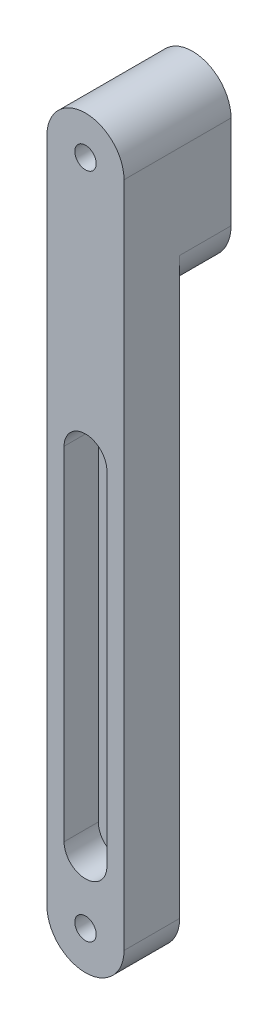
ISO-10303-21;
HEADER;
FILE_DESCRIPTION(('STEP AP214'),'2;1');
FILE_NAME('part.step','',(''),(''),'','','');
FILE_SCHEMA(('AUTOMOTIVE_DESIGN { 1 0 10303 214 1 1 1 1 }'));
ENDSEC;
DATA;
#1=APPLICATION_CONTEXT('core data for automotive mechanical design processes');
#2=APPLICATION_PROTOCOL_DEFINITION('international standard','automotive_design',2000,#1);
#3=PRODUCT_CONTEXT('',#1,'mechanical');
#4=PRODUCT('Part','Part','',(#3));
#5=PRODUCT_RELATED_PRODUCT_CATEGORY('part','',(#4));
#6=PRODUCT_DEFINITION_FORMATION('','',#4);
#7=PRODUCT_DEFINITION_CONTEXT('part definition',#1,'design');
#8=PRODUCT_DEFINITION('design','',#6,#7);
#9=PRODUCT_DEFINITION_SHAPE('','',#8);
#10=(LENGTH_UNIT() NAMED_UNIT(*) SI_UNIT(.MILLI.,.METRE.));
#11=(NAMED_UNIT(*) PLANE_ANGLE_UNIT() SI_UNIT($,.RADIAN.));
#12=(NAMED_UNIT(*) SI_UNIT($,.STERADIAN.) SOLID_ANGLE_UNIT());
#13=UNCERTAINTY_MEASURE_WITH_UNIT(LENGTH_MEASURE(1.E-05),#10,'distance_accuracy_value','');
#14=(GEOMETRIC_REPRESENTATION_CONTEXT(3) GLOBAL_UNCERTAINTY_ASSIGNED_CONTEXT((#13)) GLOBAL_UNIT_ASSIGNED_CONTEXT((#10,
#11,#12)) REPRESENTATION_CONTEXT('',''));
#15=CARTESIAN_POINT('',(0.,0.,0.));
#16=DIRECTION('',(0.,0.,1.));
#17=DIRECTION('',(1.,0.,0.));
#18=AXIS2_PLACEMENT_3D('',#15,#16,#17);
#19=CARTESIAN_POINT('',(0.,56.3943241889826,0.));
#20=DIRECTION('',(0.,0.,1.));
#21=DIRECTION('',(1.,0.,0.));
#22=AXIS2_PLACEMENT_3D('',#19,#20,#21);
#23=PLANE('',#22);
#24=CARTESIAN_POINT('',(0.,-99.5196758110174,0.));
#25=DIRECTION('',(0.,0.,1.));
#26=DIRECTION('',(1.,0.,0.));
#27=AXIS2_PLACEMENT_3D('',#24,#25,#26);
#28=CIRCLE('',#27,2.5);
#29=CARTESIAN_POINT('',(-2.49999999999998,-99.5196758110174,0.));
#30=VERTEX_POINT('',#29);
#31=EDGE_CURVE('E168',#30,#30,#28,.T.);
#32=ORIENTED_EDGE('',*,*,#31,.T.);
#33=EDGE_LOOP('',(#32));
#34=FACE_BOUND('',#33,.T.);
#35=DIRECTION('',(0.,-1.,0.));
#36=VECTOR('',#35,1.);
#37=CARTESIAN_POINT('',(-9.,56.3943241889826,0.));
#38=LINE('',#37,#36);
#39=CARTESIAN_POINT('',(-9.,34.3835962839502,0.));
#40=VERTEX_POINT('',#39);
#41=CARTESIAN_POINT('',(-8.99999999999998,-99.5196758110174,0.));
#42=VERTEX_POINT('',#41);
#43=EDGE_CURVE('E45',#40,#42,#38,.T.);
#44=ORIENTED_EDGE('',*,*,#43,.F.);
#45=CARTESIAN_POINT('',(1.,34.3835962839502,0.));
#46=DIRECTION('',(0.,0.,1.));
#47=DIRECTION('',(1.,0.,0.));
#48=AXIS2_PLACEMENT_3D('',#45,#46,#47);
#49=CIRCLE('',#48,10.);
#50=CARTESIAN_POINT('',(-0.999999999999996,24.5856373128174,0.));
#51=VERTEX_POINT('',#50);
#52=EDGE_CURVE('E11',#40,#51,#49,.T.);
#53=ORIENTED_EDGE('',*,*,#52,.T.);
#54=CARTESIAN_POINT('',(-0.999999999999996,34.5856373128174,0.));
#55=DIRECTION('',(0.,0.,1.));
#56=DIRECTION('',(1.,0.,0.));
#57=AXIS2_PLACEMENT_3D('',#54,#55,#56);
#58=CIRCLE('',#57,10.);
#59=CARTESIAN_POINT('',(9.,34.5856373128174,0.));
#60=VERTEX_POINT('',#59);
#61=EDGE_CURVE('E205',#51,#60,#58,.T.);
#62=ORIENTED_EDGE('',*,*,#61,.T.);
#63=DIRECTION('',(0.,1.,0.));
#64=VECTOR('',#63,1.);
#65=CARTESIAN_POINT('',(9.00000000000002,-99.5196758110174,0.));
#66=LINE('',#65,#64);
#67=CARTESIAN_POINT('',(9.00000000000002,-99.5196758110174,0.));
#68=VERTEX_POINT('',#67);
#69=EDGE_CURVE('E185',#68,#60,#66,.T.);
#70=ORIENTED_EDGE('',*,*,#69,.F.);
#71=CARTESIAN_POINT('',(0.,-99.5196758110174,0.));
#72=DIRECTION('',(0.,0.,1.));
#73=DIRECTION('',(1.,0.,0.));
#74=AXIS2_PLACEMENT_3D('',#71,#72,#73);
#75=CIRCLE('',#74,9.);
#76=EDGE_CURVE('E192',#42,#68,#75,.T.);
#77=ORIENTED_EDGE('',*,*,#76,.F.);
#78=EDGE_LOOP('',(#44,#53,#62,#70,#77));
#79=FACE_BOUND('',#78,.T.);
#80=ADVANCED_FACE('F31',(#34,#79),#23,.F.);
#81=CARTESIAN_POINT('',(0.,56.3943241889826,13.));
#82=DIRECTION('',(0.,0.,1.));
#83=DIRECTION('',(1.,0.,0.));
#84=AXIS2_PLACEMENT_3D('',#81,#82,#83);
#85=PLANE('',#84);
#86=CARTESIAN_POINT('',(0.,-84.5196758110174,13.));
#87=DIRECTION('',(0.,0.,1.));
#88=DIRECTION('',(1.,0.,0.));
#89=AXIS2_PLACEMENT_3D('',#86,#87,#88);
#90=CIRCLE('',#89,5.);
#91=CARTESIAN_POINT('',(-4.99999999999998,-84.5196758110174,13.));
#92=VERTEX_POINT('',#91);
#93=CARTESIAN_POINT('',(5.00000000000002,-84.5196758110174,13.));
#94=VERTEX_POINT('',#93);
#95=EDGE_CURVE('E142',#92,#94,#90,.T.);
#96=ORIENTED_EDGE('',*,*,#95,.F.);
#97=DIRECTION('',(0.,-1.,0.));
#98=VECTOR('',#97,1.);
#99=CARTESIAN_POINT('',(-4.99999999999999,-4.51967581101744,13.));
#100=LINE('',#99,#98);
#101=CARTESIAN_POINT('',(-4.99999999999999,-4.51967581101744,13.));
#102=VERTEX_POINT('',#101);
#103=EDGE_CURVE('E147',#102,#92,#100,.T.);
#104=ORIENTED_EDGE('',*,*,#103,.F.);
#105=CARTESIAN_POINT('',(0.,-4.51967581101743,13.));
#106=DIRECTION('',(0.,0.,1.));
#107=DIRECTION('',(1.,0.,0.));
#108=AXIS2_PLACEMENT_3D('',#105,#106,#107);
#109=CIRCLE('',#108,5.);
#110=CARTESIAN_POINT('',(5.00000000000001,-4.51967581101743,13.));
#111=VERTEX_POINT('',#110);
#112=EDGE_CURVE('E161',#111,#102,#109,.T.);
#113=ORIENTED_EDGE('',*,*,#112,.F.);
#114=DIRECTION('',(0.,1.,0.));
#115=VECTOR('',#114,1.);
#116=CARTESIAN_POINT('',(5.00000000000002,-84.5196758110174,13.));
#117=LINE('',#116,#115);
#118=EDGE_CURVE('E158',#94,#111,#117,.T.);
#119=ORIENTED_EDGE('',*,*,#118,.F.);
#120=EDGE_LOOP('',(#96,#104,#113,#119));
#121=FACE_BOUND('',#120,.T.);
#122=CARTESIAN_POINT('',(0.,56.3943241889826,13.));
#123=DIRECTION('',(0.,0.,1.));
#124=DIRECTION('',(1.,0.,0.));
#125=AXIS2_PLACEMENT_3D('',#122,#123,#124);
#126=CIRCLE('',#125,2.5);
#127=CARTESIAN_POINT('',(-2.5,56.3943241889826,13.));
#128=VERTEX_POINT('',#127);
#129=EDGE_CURVE('E178',#128,#128,#126,.T.);
#130=ORIENTED_EDGE('',*,*,#129,.F.);
#131=EDGE_LOOP('',(#130));
#132=FACE_BOUND('',#131,.T.);
#133=CARTESIAN_POINT('',(0.,56.3943241889826,13.));
#134=DIRECTION('',(0.,0.,1.));
#135=DIRECTION('',(1.,0.,0.));
#136=AXIS2_PLACEMENT_3D('',#133,#134,#135);
#137=CIRCLE('',#136,9.);
#138=CARTESIAN_POINT('',(9.,56.3943241889826,13.));
#139=VERTEX_POINT('',#138);
#140=CARTESIAN_POINT('',(-9.,56.3943241889826,13.));
#141=VERTEX_POINT('',#140);
#142=EDGE_CURVE('E120',#139,#141,#137,.T.);
#143=ORIENTED_EDGE('',*,*,#142,.T.);
#144=DIRECTION('',(0.,-1.,0.));
#145=VECTOR('',#144,1.);
#146=CARTESIAN_POINT('',(-9.,56.3943241889826,13.));
#147=LINE('',#146,#145);
#148=CARTESIAN_POINT('',(-8.99999999999998,-99.5196758110174,13.));
#149=VERTEX_POINT('',#148);
#150=EDGE_CURVE('E184',#141,#149,#147,.T.);
#151=ORIENTED_EDGE('',*,*,#150,.T.);
#152=CARTESIAN_POINT('',(0.,-99.5196758110174,13.));
#153=DIRECTION('',(0.,0.,1.));
#154=DIRECTION('',(1.,0.,0.));
#155=AXIS2_PLACEMENT_3D('',#152,#153,#154);
#156=CIRCLE('',#155,9.);
#157=CARTESIAN_POINT('',(9.00000000000002,-99.5196758110174,13.));
#158=VERTEX_POINT('',#157);
#159=EDGE_CURVE('E187',#149,#158,#156,.T.);
#160=ORIENTED_EDGE('',*,*,#159,.T.);
#161=DIRECTION('',(0.,1.,0.));
#162=VECTOR('',#161,1.);
#163=CARTESIAN_POINT('',(9.00000000000002,-99.5196758110174,13.));
#164=LINE('',#163,#162);
#165=EDGE_CURVE('E124',#158,#139,#164,.T.);
#166=ORIENTED_EDGE('',*,*,#165,.T.);
#167=EDGE_LOOP('',(#143,#151,#160,#166));
#168=FACE_BOUND('',#167,.T.);
#169=CARTESIAN_POINT('',(0.,-99.5196758110174,13.));
#170=DIRECTION('',(0.,0.,1.));
#171=DIRECTION('',(1.,0.,0.));
#172=AXIS2_PLACEMENT_3D('',#169,#170,#171);
#173=CIRCLE('',#172,2.5);
#174=CARTESIAN_POINT('',(-2.49999999999998,-99.5196758110174,13.));
#175=VERTEX_POINT('',#174);
#176=EDGE_CURVE('E175',#175,#175,#173,.T.);
#177=ORIENTED_EDGE('',*,*,#176,.F.);
#178=EDGE_LOOP('',(#177));
#179=FACE_BOUND('',#178,.T.);
#180=ADVANCED_FACE('F231',(#121,#132,#168,#179),#85,.T.);
#181=CARTESIAN_POINT('',(0.,56.3943241889826,13.));
#182=DIRECTION('',(0.,0.,-1.));
#183=DIRECTION('',(-1.,0.,0.));
#184=AXIS2_PLACEMENT_3D('',#181,#182,#183);
#185=CYLINDRICAL_SURFACE('',#184,9.);
#186=DIRECTION('',(0.,0.,-1.));
#187=VECTOR('',#186,1.);
#188=CARTESIAN_POINT('',(9.,56.3943241889826,13.));
#189=LINE('',#188,#187);
#190=CARTESIAN_POINT('',(9.,56.3943241889826,-12.));
#191=VERTEX_POINT('',#190);
#192=EDGE_CURVE('E113',#139,#191,#189,.T.);
#193=ORIENTED_EDGE('',*,*,#192,.T.);
#194=CARTESIAN_POINT('',(0.,56.3943241889826,-12.));
#195=DIRECTION('',(0.,0.,-1.));
#196=DIRECTION('',(-1.,0.,0.));
#197=AXIS2_PLACEMENT_3D('',#194,#195,#196);
#198=CIRCLE('',#197,9.);
#199=CARTESIAN_POINT('',(-9.,56.3943241889826,-12.));
#200=VERTEX_POINT('',#199);
#201=EDGE_CURVE('E118',#200,#191,#198,.T.);
#202=ORIENTED_EDGE('',*,*,#201,.F.);
#203=DIRECTION('',(0.,0.,-1.));
#204=VECTOR('',#203,1.);
#205=CARTESIAN_POINT('',(-9.,56.3943241889826,13.));
#206=LINE('',#205,#204);
#207=EDGE_CURVE('E201',#141,#200,#206,.T.);
#208=ORIENTED_EDGE('',*,*,#207,.F.);
#209=ORIENTED_EDGE('',*,*,#142,.F.);
#210=EDGE_LOOP('',(#193,#202,#208,#209));
#211=FACE_BOUND('',#210,.T.);
#212=ADVANCED_FACE('F115',(#211),#185,.T.);
#213=CARTESIAN_POINT('',(-9.,56.3943241889826,13.));
#214=DIRECTION('',(1.,0.,0.));
#215=DIRECTION('',(0.,1.,0.));
#216=AXIS2_PLACEMENT_3D('',#213,#214,#215);
#217=PLANE('',#216);
#218=DIRECTION('',(0.,1.,0.));
#219=VECTOR('',#218,1.);
#220=CARTESIAN_POINT('',(-9.,24.5856373128174,-12.));
#221=LINE('',#220,#219);
#222=CARTESIAN_POINT('',(-9.,34.3835962839502,-12.));
#223=VERTEX_POINT('',#222);
#224=EDGE_CURVE('E132',#223,#200,#221,.T.);
#225=ORIENTED_EDGE('',*,*,#224,.F.);
#226=DIRECTION('',(0.,0.,1.));
#227=VECTOR('',#226,1.);
#228=CARTESIAN_POINT('',(-9.,34.3835962839502,13.));
#229=LINE('',#228,#227);
#230=EDGE_CURVE('E208',#223,#40,#229,.T.);
#231=ORIENTED_EDGE('',*,*,#230,.T.);
#232=ORIENTED_EDGE('',*,*,#43,.T.);
#233=DIRECTION('',(0.,0.,-1.));
#234=VECTOR('',#233,1.);
#235=CARTESIAN_POINT('',(-8.99999999999998,-99.5196758110174,13.));
#236=LINE('',#235,#234);
#237=EDGE_CURVE('E394',#149,#42,#236,.T.);
#238=ORIENTED_EDGE('',*,*,#237,.F.);
#239=ORIENTED_EDGE('',*,*,#150,.F.);
#240=ORIENTED_EDGE('',*,*,#207,.T.);
#241=EDGE_LOOP('',(#225,#231,#232,#238,#239,#240));
#242=FACE_BOUND('',#241,.T.);
#243=ADVANCED_FACE('F212',(#242),#217,.F.);
#244=CARTESIAN_POINT('',(0.,-99.5196758110174,13.));
#245=DIRECTION('',(0.,0.,-1.));
#246=DIRECTION('',(-1.,0.,0.));
#247=AXIS2_PLACEMENT_3D('',#244,#245,#246);
#248=CYLINDRICAL_SURFACE('',#247,9.);
#249=ORIENTED_EDGE('',*,*,#76,.T.);
#250=DIRECTION('',(0.,0.,-1.));
#251=VECTOR('',#250,1.);
#252=CARTESIAN_POINT('',(9.00000000000002,-99.5196758110174,13.));
#253=LINE('',#252,#251);
#254=EDGE_CURVE('E123',#158,#68,#253,.T.);
#255=ORIENTED_EDGE('',*,*,#254,.F.);
#256=ORIENTED_EDGE('',*,*,#159,.F.);
#257=ORIENTED_EDGE('',*,*,#237,.T.);
#258=EDGE_LOOP('',(#249,#255,#256,#257));
#259=FACE_BOUND('',#258,.T.);
#260=ADVANCED_FACE('F244',(#259),#248,.T.);
#261=CARTESIAN_POINT('',(9.00000000000002,-99.5196758110174,13.));
#262=DIRECTION('',(-1.,0.,0.));
#263=DIRECTION('',(0.,-1.,0.));
#264=AXIS2_PLACEMENT_3D('',#261,#262,#263);
#265=PLANE('',#264);
#266=ORIENTED_EDGE('',*,*,#69,.T.);
#267=DIRECTION('',(0.,0.,1.));
#268=VECTOR('',#267,1.);
#269=CARTESIAN_POINT('',(9.,34.5856373128175,13.));
#270=LINE('',#269,#268);
#271=CARTESIAN_POINT('',(9.,34.5856373128174,-12.));
#272=VERTEX_POINT('',#271);
#273=EDGE_CURVE('E130',#60,#272,#270,.F.);
#274=ORIENTED_EDGE('',*,*,#273,.T.);
#275=DIRECTION('',(0.,-1.,0.));
#276=VECTOR('',#275,1.);
#277=CARTESIAN_POINT('',(9.,56.3943241889826,-12.));
#278=LINE('',#277,#276);
#279=EDGE_CURVE('E127',#191,#272,#278,.T.);
#280=ORIENTED_EDGE('',*,*,#279,.F.);
#281=ORIENTED_EDGE('',*,*,#192,.F.);
#282=ORIENTED_EDGE('',*,*,#165,.F.);
#283=ORIENTED_EDGE('',*,*,#254,.T.);
#284=EDGE_LOOP('',(#266,#274,#280,#281,#282,#283));
#285=FACE_BOUND('',#284,.T.);
#286=ADVANCED_FACE('F128',(#285),#265,.F.);
#287=CARTESIAN_POINT('',(0.,56.3943241889826,13.));
#288=DIRECTION('',(0.,0.,-1.));
#289=DIRECTION('',(-1.,0.,0.));
#290=AXIS2_PLACEMENT_3D('',#287,#288,#289);
#291=CYLINDRICAL_SURFACE('',#290,2.5);
#292=CARTESIAN_POINT('',(0.,56.3943241889826,-12.));
#293=DIRECTION('',(0.,0.,1.));
#294=DIRECTION('',(1.,0.,0.));
#295=AXIS2_PLACEMENT_3D('',#292,#293,#294);
#296=CIRCLE('',#295,2.5);
#297=CARTESIAN_POINT('',(-2.5,56.3943241889826,-12.));
#298=VERTEX_POINT('',#297);
#299=EDGE_CURVE('E136',#298,#298,#296,.T.);
#300=CARTESIAN_POINT('',(-2.5,56.3943241889826,13.));
#301=CARTESIAN_POINT('',(-2.5,56.3943241889826,12.7395833333333));
#302=CARTESIAN_POINT('',(-2.5,56.3943241889826,12.4791666666667));
#303=CARTESIAN_POINT('',(-2.5,56.3943241889826,11.9583333333333));
#304=CARTESIAN_POINT('',(-2.5,56.3943241889826,11.6979166666667));
#305=CARTESIAN_POINT('',(-2.5,56.3943241889826,11.1770833333333));
#306=CARTESIAN_POINT('',(-2.5,56.3943241889826,10.9166666666667));
#307=CARTESIAN_POINT('',(-2.5,56.3943241889826,10.3958333333333));
#308=CARTESIAN_POINT('',(-2.5,56.3943241889826,10.1354166666667));
#309=CARTESIAN_POINT('',(-2.5,56.3943241889826,9.61458333333333));
#310=CARTESIAN_POINT('',(-2.5,56.3943241889826,9.35416666666666));
#311=CARTESIAN_POINT('',(-2.5,56.3943241889826,8.83333333333333));
#312=CARTESIAN_POINT('',(-2.5,56.3943241889826,8.57291666666666));
#313=CARTESIAN_POINT('',(-2.5,56.3943241889826,8.05208333333333));
#314=CARTESIAN_POINT('',(-2.5,56.3943241889826,7.79166666666666));
#315=CARTESIAN_POINT('',(-2.5,56.3943241889826,7.27083333333333));
#316=CARTESIAN_POINT('',(-2.5,56.3943241889826,7.01041666666666));
#317=CARTESIAN_POINT('',(-2.5,56.3943241889826,6.48958333333333));
#318=CARTESIAN_POINT('',(-2.5,56.3943241889826,6.22916666666666));
#319=CARTESIAN_POINT('',(-2.5,56.3943241889826,5.70833333333333));
#320=CARTESIAN_POINT('',(-2.5,56.3943241889826,5.44791666666666));
#321=CARTESIAN_POINT('',(-2.5,56.3943241889826,4.92708333333333));
#322=CARTESIAN_POINT('',(-2.5,56.3943241889826,4.66666666666667));
#323=CARTESIAN_POINT('',(-2.5,56.3943241889826,4.14583333333333));
#324=CARTESIAN_POINT('',(-2.5,56.3943241889826,3.88541666666667));
#325=CARTESIAN_POINT('',(-2.5,56.3943241889826,3.36458333333333));
#326=CARTESIAN_POINT('',(-2.5,56.3943241889826,3.10416666666666));
#327=CARTESIAN_POINT('',(-2.5,56.3943241889826,2.58333333333333));
#328=CARTESIAN_POINT('',(-2.5,56.3943241889826,2.32291666666666));
#329=CARTESIAN_POINT('',(-2.5,56.3943241889826,1.80208333333333));
#330=CARTESIAN_POINT('',(-2.5,56.3943241889826,1.54166666666666));
#331=CARTESIAN_POINT('',(-2.5,56.3943241889826,1.02083333333333));
#332=CARTESIAN_POINT('',(-2.5,56.3943241889826,0.760416666666664));
#333=CARTESIAN_POINT('',(-2.5,56.3943241889826,0.23958333333333));
#334=CARTESIAN_POINT('',(-2.5,56.3943241889826,-0.0208333333333368));
#335=CARTESIAN_POINT('',(-2.5,56.3943241889826,-0.541666666666671));
#336=CARTESIAN_POINT('',(-2.5,56.3943241889826,-0.802083333333338));
#337=CARTESIAN_POINT('',(-2.5,56.3943241889826,-1.32291666666667));
#338=CARTESIAN_POINT('',(-2.5,56.3943241889826,-1.58333333333334));
#339=CARTESIAN_POINT('',(-2.5,56.3943241889826,-2.10416666666667));
#340=CARTESIAN_POINT('',(-2.5,56.3943241889826,-2.36458333333334));
#341=CARTESIAN_POINT('',(-2.5,56.3943241889826,-2.88541666666667));
#342=CARTESIAN_POINT('',(-2.5,56.3943241889826,-3.14583333333334));
#343=CARTESIAN_POINT('',(-2.5,56.3943241889826,-3.66666666666667));
#344=CARTESIAN_POINT('',(-2.5,56.3943241889826,-3.92708333333334));
#345=CARTESIAN_POINT('',(-2.5,56.3943241889826,-4.44791666666667));
#346=CARTESIAN_POINT('',(-2.5,56.3943241889826,-4.70833333333334));
#347=CARTESIAN_POINT('',(-2.5,56.3943241889826,-5.22916666666667));
#348=CARTESIAN_POINT('',(-2.5,56.3943241889826,-5.48958333333334));
#349=CARTESIAN_POINT('',(-2.5,56.3943241889826,-6.01041666666667));
#350=CARTESIAN_POINT('',(-2.5,56.3943241889826,-6.27083333333334));
#351=CARTESIAN_POINT('',(-2.5,56.3943241889826,-6.79166666666667));
#352=CARTESIAN_POINT('',(-2.5,56.3943241889826,-7.05208333333334));
#353=CARTESIAN_POINT('',(-2.5,56.3943241889826,-7.57291666666667));
#354=CARTESIAN_POINT('',(-2.5,56.3943241889826,-7.83333333333334));
#355=CARTESIAN_POINT('',(-2.5,56.3943241889826,-8.35416666666667));
#356=CARTESIAN_POINT('',(-2.5,56.3943241889826,-8.61458333333334));
#357=CARTESIAN_POINT('',(-2.5,56.3943241889826,-9.13541666666667));
#358=CARTESIAN_POINT('',(-2.5,56.3943241889826,-9.39583333333334));
#359=CARTESIAN_POINT('',(-2.5,56.3943241889826,-9.91666666666667));
#360=CARTESIAN_POINT('',(-2.5,56.3943241889826,-10.1770833333333));
#361=CARTESIAN_POINT('',(-2.5,56.3943241889826,-10.6979166666667));
#362=CARTESIAN_POINT('',(-2.5,56.3943241889826,-10.9583333333333));
#363=CARTESIAN_POINT('',(-2.5,56.3943241889826,-11.4791666666667));
#364=CARTESIAN_POINT('',(-2.5,56.3943241889826,-11.7395833333333));
#365=CARTESIAN_POINT('',(-2.5,56.3943241889826,-12.));
#366=B_SPLINE_CURVE_WITH_KNOTS('',3,(#300,#301,#302,#303,#304,#305,#306,#307,#308,#309,#310,
#311,#312,#313,#314,#315,#316,#317,#318,#319,#320,#321,#322,#323,#324,#325,#326,#327,#328,#329,
#330,#331,#332,#333,#334,#335,#336,#337,#338,#339,#340,#341,#342,#343,#344,#345,#346,#347,#348,
#349,#350,#351,#352,#353,#354,#355,#356,#357,#358,#359,#360,#361,#362,#363,#364,#365),
.UNSPECIFIED.,.F.,.F.,(4,2,2,2,2,2,2,2,2,2,2,2,2,2,2,2,2,2,2,2,2,2,2,2,2,2,2,2,2,2,2,2,4),(0.,
0.781250000000001,1.5625,2.34375,3.125,3.90625,4.6875,5.46875,6.25,7.03125,7.8125,8.59375,9.375,
10.15625,10.9375,11.71875,12.5,13.28125,14.0625,14.84375,15.625,16.40625,17.1875,17.96875,18.75,
19.53125,20.3125,21.09375,21.875,22.65625,23.4375,24.21875,25.),.UNSPECIFIED.);
#367=EDGE_CURVE('BSEAM243',#128,#298,#366,.T.);
#368=ORIENTED_EDGE('',*,*,#129,.T.);
#369=ORIENTED_EDGE('',*,*,#299,.F.);
#370=ORIENTED_EDGE('',*,*,#367,.T.);
#371=ORIENTED_EDGE('',*,*,#367,.F.);
#372=EDGE_LOOP('',(#368,#370,#369,#371));
#373=FACE_BOUND('',#372,.T.);
#374=ADVANCED_FACE('F243',(#373),#291,.F.);
#375=CARTESIAN_POINT('',(0.,-99.5196758110174,13.));
#376=DIRECTION('',(0.,0.,-1.));
#377=DIRECTION('',(-1.,0.,0.));
#378=AXIS2_PLACEMENT_3D('',#375,#376,#377);
#379=CYLINDRICAL_SURFACE('',#378,2.5);
#380=CARTESIAN_POINT('',(-2.49999999999998,-99.5196758110174,13.));
#381=CARTESIAN_POINT('',(-2.49999999999998,-99.5196758110174,12.8645833333333));
#382=CARTESIAN_POINT('',(-2.49999999999998,-99.5196758110174,12.7291666666667));
#383=CARTESIAN_POINT('',(-2.49999999999998,-99.5196758110174,12.4583333333333));
#384=CARTESIAN_POINT('',(-2.49999999999998,-99.5196758110174,12.3229166666667));
#385=CARTESIAN_POINT('',(-2.49999999999998,-99.5196758110174,12.0520833333333));
#386=CARTESIAN_POINT('',(-2.49999999999998,-99.5196758110174,11.9166666666667));
#387=CARTESIAN_POINT('',(-2.49999999999998,-99.5196758110174,11.6458333333333));
#388=CARTESIAN_POINT('',(-2.49999999999998,-99.5196758110174,11.5104166666667));
#389=CARTESIAN_POINT('',(-2.49999999999998,-99.5196758110174,11.2395833333333));
#390=CARTESIAN_POINT('',(-2.49999999999998,-99.5196758110174,11.1041666666667));
#391=CARTESIAN_POINT('',(-2.49999999999998,-99.5196758110174,10.8333333333333));
#392=CARTESIAN_POINT('',(-2.49999999999998,-99.5196758110174,10.6979166666667));
#393=CARTESIAN_POINT('',(-2.49999999999998,-99.5196758110174,10.4270833333333));
#394=CARTESIAN_POINT('',(-2.49999999999998,-99.5196758110174,10.2916666666667));
#395=CARTESIAN_POINT('',(-2.49999999999998,-99.5196758110174,10.0208333333333));
#396=CARTESIAN_POINT('',(-2.49999999999998,-99.5196758110174,9.88541666666667));
#397=CARTESIAN_POINT('',(-2.49999999999998,-99.5196758110174,9.61458333333333));
#398=CARTESIAN_POINT('',(-2.49999999999998,-99.5196758110174,9.47916666666667));
#399=CARTESIAN_POINT('',(-2.49999999999998,-99.5196758110174,9.20833333333333));
#400=CARTESIAN_POINT('',(-2.49999999999998,-99.5196758110174,9.07291666666667));
#401=CARTESIAN_POINT('',(-2.49999999999998,-99.5196758110174,8.80208333333333));
#402=CARTESIAN_POINT('',(-2.49999999999998,-99.5196758110174,8.66666666666667));
#403=CARTESIAN_POINT('',(-2.49999999999998,-99.5196758110174,8.39583333333333));
#404=CARTESIAN_POINT('',(-2.49999999999998,-99.5196758110174,8.26041666666667));
#405=CARTESIAN_POINT('',(-2.49999999999998,-99.5196758110174,7.98958333333333));
#406=CARTESIAN_POINT('',(-2.49999999999998,-99.5196758110174,7.85416666666667));
#407=CARTESIAN_POINT('',(-2.49999999999998,-99.5196758110174,7.58333333333333));
#408=CARTESIAN_POINT('',(-2.49999999999998,-99.5196758110174,7.44791666666667));
#409=CARTESIAN_POINT('',(-2.49999999999998,-99.5196758110174,7.17708333333333));
#410=CARTESIAN_POINT('',(-2.49999999999998,-99.5196758110174,7.04166666666667));
#411=CARTESIAN_POINT('',(-2.49999999999998,-99.5196758110174,6.77083333333333));
#412=CARTESIAN_POINT('',(-2.49999999999998,-99.5196758110174,6.63541666666667));
#413=CARTESIAN_POINT('',(-2.49999999999998,-99.5196758110174,6.36458333333333));
#414=CARTESIAN_POINT('',(-2.49999999999998,-99.5196758110174,6.22916666666667));
#415=CARTESIAN_POINT('',(-2.49999999999998,-99.5196758110174,5.95833333333333));
#416=CARTESIAN_POINT('',(-2.49999999999998,-99.5196758110174,5.82291666666667));
#417=CARTESIAN_POINT('',(-2.49999999999998,-99.5196758110174,5.55208333333333));
#418=CARTESIAN_POINT('',(-2.49999999999998,-99.5196758110174,5.41666666666667));
#419=CARTESIAN_POINT('',(-2.49999999999998,-99.5196758110174,5.14583333333333));
#420=CARTESIAN_POINT('',(-2.49999999999998,-99.5196758110174,5.01041666666667));
#421=CARTESIAN_POINT('',(-2.49999999999998,-99.5196758110174,4.73958333333333));
#422=CARTESIAN_POINT('',(-2.49999999999998,-99.5196758110174,4.60416666666667));
#423=CARTESIAN_POINT('',(-2.49999999999998,-99.5196758110174,4.33333333333333));
#424=CARTESIAN_POINT('',(-2.49999999999998,-99.5196758110174,4.19791666666667));
#425=CARTESIAN_POINT('',(-2.49999999999998,-99.5196758110174,3.92708333333333));
#426=CARTESIAN_POINT('',(-2.49999999999998,-99.5196758110174,3.79166666666667));
#427=CARTESIAN_POINT('',(-2.49999999999998,-99.5196758110174,3.52083333333333));
#428=CARTESIAN_POINT('',(-2.49999999999998,-99.5196758110174,3.38541666666667));
#429=CARTESIAN_POINT('',(-2.49999999999998,-99.5196758110174,3.11458333333333));
#430=CARTESIAN_POINT('',(-2.49999999999998,-99.5196758110174,2.97916666666667));
#431=CARTESIAN_POINT('',(-2.49999999999998,-99.5196758110174,2.70833333333333));
#432=CARTESIAN_POINT('',(-2.49999999999998,-99.5196758110174,2.57291666666667));
#433=CARTESIAN_POINT('',(-2.49999999999998,-99.5196758110174,2.30208333333333));
#434=CARTESIAN_POINT('',(-2.49999999999998,-99.5196758110174,2.16666666666667));
#435=CARTESIAN_POINT('',(-2.49999999999998,-99.5196758110174,1.89583333333333));
#436=CARTESIAN_POINT('',(-2.49999999999998,-99.5196758110174,1.76041666666667));
#437=CARTESIAN_POINT('',(-2.49999999999998,-99.5196758110174,1.48958333333333));
#438=CARTESIAN_POINT('',(-2.49999999999998,-99.5196758110174,1.35416666666667));
#439=CARTESIAN_POINT('',(-2.49999999999998,-99.5196758110174,1.08333333333333));
#440=CARTESIAN_POINT('',(-2.49999999999998,-99.5196758110174,0.947916666666667));
#441=CARTESIAN_POINT('',(-2.49999999999998,-99.5196758110174,0.677083333333334));
#442=CARTESIAN_POINT('',(-2.49999999999998,-99.5196758110174,0.541666666666667));
#443=CARTESIAN_POINT('',(-2.49999999999998,-99.5196758110174,0.270833333333334));
#444=CARTESIAN_POINT('',(-2.49999999999998,-99.5196758110174,0.135416666666667));
#445=CARTESIAN_POINT('',(-2.49999999999998,-99.5196758110174,0.));
#446=B_SPLINE_CURVE_WITH_KNOTS('',3,(#380,#381,#382,#383,#384,#385,#386,#387,#388,#389,#390,
#391,#392,#393,#394,#395,#396,#397,#398,#399,#400,#401,#402,#403,#404,#405,#406,#407,#408,#409,
#410,#411,#412,#413,#414,#415,#416,#417,#418,#419,#420,#421,#422,#423,#424,#425,#426,#427,#428,
#429,#430,#431,#432,#433,#434,#435,#436,#437,#438,#439,#440,#441,#442,#443,#444,#445),
.UNSPECIFIED.,.F.,.F.,(4,2,2,2,2,2,2,2,2,2,2,2,2,2,2,2,2,2,2,2,2,2,2,2,2,2,2,2,2,2,2,2,4),(0.,
0.406249999999999,0.812499999999999,1.21875,1.625,2.03125,2.4375,2.84375,3.25,3.65625,4.0625,
4.46875,4.875,5.28125,5.6875,6.09375,6.5,6.90625,7.3125,7.71875,8.125,8.53125,8.9375,9.34375,
9.75,10.15625,10.5625,10.96875,11.375,11.78125,12.1875,12.59375,13.),.UNSPECIFIED.);
#447=EDGE_CURVE('BSEAM274',#175,#30,#446,.T.);
#448=ORIENTED_EDGE('',*,*,#176,.T.);
#449=ORIENTED_EDGE('',*,*,#31,.F.);
#450=ORIENTED_EDGE('',*,*,#447,.T.);
#451=ORIENTED_EDGE('',*,*,#447,.F.);
#452=EDGE_LOOP('',(#448,#450,#449,#451));
#453=FACE_BOUND('',#452,.T.);
#454=ADVANCED_FACE('F274',(#453),#379,.F.);
#455=CARTESIAN_POINT('',(0.,-84.5196758110174,5.));
#456=DIRECTION('',(0.,0.,1.));
#457=DIRECTION('',(1.,0.,0.));
#458=AXIS2_PLACEMENT_3D('',#455,#456,#457);
#459=CYLINDRICAL_SURFACE('',#458,5.);
#460=ORIENTED_EDGE('',*,*,#95,.T.);
#461=DIRECTION('',(0.,0.,1.));
#462=VECTOR('',#461,1.);
#463=CARTESIAN_POINT('',(5.00000000000002,-84.5196758110174,5.));
#464=LINE('',#463,#462);
#465=CARTESIAN_POINT('',(5.00000000000002,-84.5196758110174,5.));
#466=VERTEX_POINT('',#465);
#467=EDGE_CURVE('E156',#466,#94,#464,.T.);
#468=ORIENTED_EDGE('',*,*,#467,.F.);
#469=CARTESIAN_POINT('',(0.,-84.5196758110174,5.));
#470=DIRECTION('',(0.,0.,1.));
#471=DIRECTION('',(1.,0.,0.));
#472=AXIS2_PLACEMENT_3D('',#469,#470,#471);
#473=CIRCLE('',#472,5.);
#474=CARTESIAN_POINT('',(-4.99999999999998,-84.5196758110174,5.));
#475=VERTEX_POINT('',#474);
#476=EDGE_CURVE('E143',#475,#466,#473,.T.);
#477=ORIENTED_EDGE('',*,*,#476,.F.);
#478=DIRECTION('',(0.,0.,1.));
#479=VECTOR('',#478,1.);
#480=CARTESIAN_POINT('',(-4.99999999999998,-84.5196758110174,5.));
#481=LINE('',#480,#479);
#482=EDGE_CURVE('E166',#475,#92,#481,.T.);
#483=ORIENTED_EDGE('',*,*,#482,.T.);
#484=EDGE_LOOP('',(#460,#468,#477,#483));
#485=FACE_BOUND('',#484,.T.);
#486=ADVANCED_FACE('F282',(#485),#459,.F.);
#487=CARTESIAN_POINT('',(-4.99999999999999,-4.51967581101744,5.));
#488=DIRECTION('',(-1.,0.,0.));
#489=DIRECTION('',(0.,-1.,0.));
#490=AXIS2_PLACEMENT_3D('',#487,#488,#489);
#491=PLANE('',#490);
#492=ORIENTED_EDGE('',*,*,#103,.T.);
#493=ORIENTED_EDGE('',*,*,#482,.F.);
#494=DIRECTION('',(0.,-1.,0.));
#495=VECTOR('',#494,1.);
#496=CARTESIAN_POINT('',(-4.99999999999999,-4.51967581101744,5.));
#497=LINE('',#496,#495);
#498=CARTESIAN_POINT('',(-4.99999999999999,-4.51967581101744,5.));
#499=VERTEX_POINT('',#498);
#500=EDGE_CURVE('E153',#499,#475,#497,.T.);
#501=ORIENTED_EDGE('',*,*,#500,.F.);
#502=DIRECTION('',(0.,0.,1.));
#503=VECTOR('',#502,1.);
#504=CARTESIAN_POINT('',(-4.99999999999999,-4.51967581101744,5.));
#505=LINE('',#504,#503);
#506=EDGE_CURVE('E169',#499,#102,#505,.T.);
#507=ORIENTED_EDGE('',*,*,#506,.T.);
#508=EDGE_LOOP('',(#492,#493,#501,#507));
#509=FACE_BOUND('',#508,.T.);
#510=ADVANCED_FACE('F290',(#509),#491,.F.);
#511=CARTESIAN_POINT('',(0.,-4.51967581101743,5.));
#512=DIRECTION('',(0.,0.,1.));
#513=DIRECTION('',(1.,0.,0.));
#514=AXIS2_PLACEMENT_3D('',#511,#512,#513);
#515=CYLINDRICAL_SURFACE('',#514,5.);
#516=ORIENTED_EDGE('',*,*,#112,.T.);
#517=ORIENTED_EDGE('',*,*,#506,.F.);
#518=CARTESIAN_POINT('',(0.,-4.51967581101743,5.));
#519=DIRECTION('',(0.,0.,1.));
#520=DIRECTION('',(1.,0.,0.));
#521=AXIS2_PLACEMENT_3D('',#518,#519,#520);
#522=CIRCLE('',#521,5.);
#523=CARTESIAN_POINT('',(5.00000000000001,-4.51967581101743,5.));
#524=VERTEX_POINT('',#523);
#525=EDGE_CURVE('E150',#524,#499,#522,.T.);
#526=ORIENTED_EDGE('',*,*,#525,.F.);
#527=DIRECTION('',(0.,0.,1.));
#528=VECTOR('',#527,1.);
#529=CARTESIAN_POINT('',(5.00000000000001,-4.51967581101743,5.));
#530=LINE('',#529,#528);
#531=EDGE_CURVE('E171',#524,#111,#530,.T.);
#532=ORIENTED_EDGE('',*,*,#531,.T.);
#533=EDGE_LOOP('',(#516,#517,#526,#532));
#534=FACE_BOUND('',#533,.T.);
#535=ADVANCED_FACE('F298',(#534),#515,.F.);
#536=CARTESIAN_POINT('',(5.00000000000002,-84.5196758110174,5.));
#537=DIRECTION('',(1.,0.,0.));
#538=DIRECTION('',(0.,1.,0.));
#539=AXIS2_PLACEMENT_3D('',#536,#537,#538);
#540=PLANE('',#539);
#541=ORIENTED_EDGE('',*,*,#118,.T.);
#542=ORIENTED_EDGE('',*,*,#531,.F.);
#543=DIRECTION('',(0.,1.,0.));
#544=VECTOR('',#543,1.);
#545=CARTESIAN_POINT('',(5.00000000000002,-84.5196758110174,5.));
#546=LINE('',#545,#544);
#547=EDGE_CURVE('E146',#466,#524,#546,.T.);
#548=ORIENTED_EDGE('',*,*,#547,.F.);
#549=ORIENTED_EDGE('',*,*,#467,.T.);
#550=EDGE_LOOP('',(#541,#542,#548,#549));
#551=FACE_BOUND('',#550,.T.);
#552=ADVANCED_FACE('F306',(#551),#540,.F.);
#553=CARTESIAN_POINT('',(0.,-84.5196758110174,5.));
#554=DIRECTION('',(0.,0.,1.));
#555=DIRECTION('',(1.,0.,0.));
#556=AXIS2_PLACEMENT_3D('',#553,#554,#555);
#557=PLANE('',#556);
#558=ORIENTED_EDGE('',*,*,#476,.T.);
#559=ORIENTED_EDGE('',*,*,#547,.T.);
#560=ORIENTED_EDGE('',*,*,#525,.T.);
#561=ORIENTED_EDGE('',*,*,#500,.T.);
#562=EDGE_LOOP('',(#558,#559,#560,#561));
#563=FACE_BOUND('',#562,.T.);
#564=ADVANCED_FACE('F226',(#563),#557,.T.);
#565=CARTESIAN_POINT('',(0.,56.3943241889826,-12.));
#566=DIRECTION('',(0.,0.,-1.));
#567=DIRECTION('',(-1.,0.,0.));
#568=AXIS2_PLACEMENT_3D('',#565,#566,#567);
#569=PLANE('',#568);
#570=ORIENTED_EDGE('',*,*,#299,.T.);
#571=EDGE_LOOP('',(#570));
#572=FACE_BOUND('',#571,.T.);
#573=CARTESIAN_POINT('',(-0.999999999999996,34.5856373128174,-12.));
#574=DIRECTION('',(0.,0.,-1.));
#575=DIRECTION('',(-1.,0.,0.));
#576=AXIS2_PLACEMENT_3D('',#573,#574,#575);
#577=CIRCLE('',#576,10.);
#578=CARTESIAN_POINT('',(-0.999999999999996,24.5856373128174,-12.));
#579=VERTEX_POINT('',#578);
#580=EDGE_CURVE('E203',#272,#579,#577,.T.);
#581=ORIENTED_EDGE('',*,*,#580,.T.);
#582=CARTESIAN_POINT('',(1.,34.3835962839502,-12.));
#583=DIRECTION('',(0.,0.,-1.));
#584=DIRECTION('',(-1.,0.,0.));
#585=AXIS2_PLACEMENT_3D('',#582,#583,#584);
#586=CIRCLE('',#585,10.);
#587=EDGE_CURVE('E39',#579,#223,#586,.T.);
#588=ORIENTED_EDGE('',*,*,#587,.T.);
#589=ORIENTED_EDGE('',*,*,#224,.T.);
#590=ORIENTED_EDGE('',*,*,#201,.T.);
#591=ORIENTED_EDGE('',*,*,#279,.T.);
#592=EDGE_LOOP('',(#581,#588,#589,#590,#591));
#593=FACE_BOUND('',#592,.T.);
#594=ADVANCED_FACE('F134',(#572,#593),#569,.T.);
#595=CARTESIAN_POINT('',(-0.999999999999996,34.5856373128174,-12.));
#596=DIRECTION('',(0.,0.,1.));
#597=DIRECTION('',(1.,0.,0.));
#598=AXIS2_PLACEMENT_3D('',#595,#596,#597);
#599=CYLINDRICAL_SURFACE('',#598,10.);
#600=ORIENTED_EDGE('',*,*,#580,.F.);
#601=ORIENTED_EDGE('',*,*,#273,.F.);
#602=ORIENTED_EDGE('',*,*,#61,.F.);
#603=DIRECTION('',(0.,0.,1.));
#604=VECTOR('',#603,1.);
#605=CARTESIAN_POINT('',(-0.999999999999996,24.5856373128174,-12.));
#606=LINE('',#605,#604);
#607=EDGE_CURVE('E198',#579,#51,#606,.T.);
#608=ORIENTED_EDGE('',*,*,#607,.F.);
#609=EDGE_LOOP('',(#600,#601,#602,#608));
#610=FACE_BOUND('',#609,.T.);
#611=ADVANCED_FACE('F220',(#610),#599,.T.);
#612=CARTESIAN_POINT('',(1.,34.3835962839502,-12.));
#613=DIRECTION('',(0.,0.,1.));
#614=DIRECTION('',(1.,0.,0.));
#615=AXIS2_PLACEMENT_3D('',#612,#613,#614);
#616=CYLINDRICAL_SURFACE('',#615,10.);
#617=ORIENTED_EDGE('',*,*,#587,.F.);
#618=ORIENTED_EDGE('',*,*,#607,.T.);
#619=ORIENTED_EDGE('',*,*,#52,.F.);
#620=ORIENTED_EDGE('',*,*,#230,.F.);
#621=EDGE_LOOP('',(#617,#618,#619,#620));
#622=FACE_BOUND('',#621,.T.);
#623=ADVANCED_FACE('F33',(#622),#616,.T.);
#624=CLOSED_SHELL('',(#80,#180,#212,#243,#260,#286,#374,#454,#486,#510,#535,#552,#564,#594,#611,#623));
#625=MANIFOLD_SOLID_BREP('B2',#624);
#626=ADVANCED_BREP_SHAPE_REPRESENTATION('',(#18,#625),#14);
#627=SHAPE_DEFINITION_REPRESENTATION(#9,#626);
ENDSEC;
END-ISO-10303-21;
